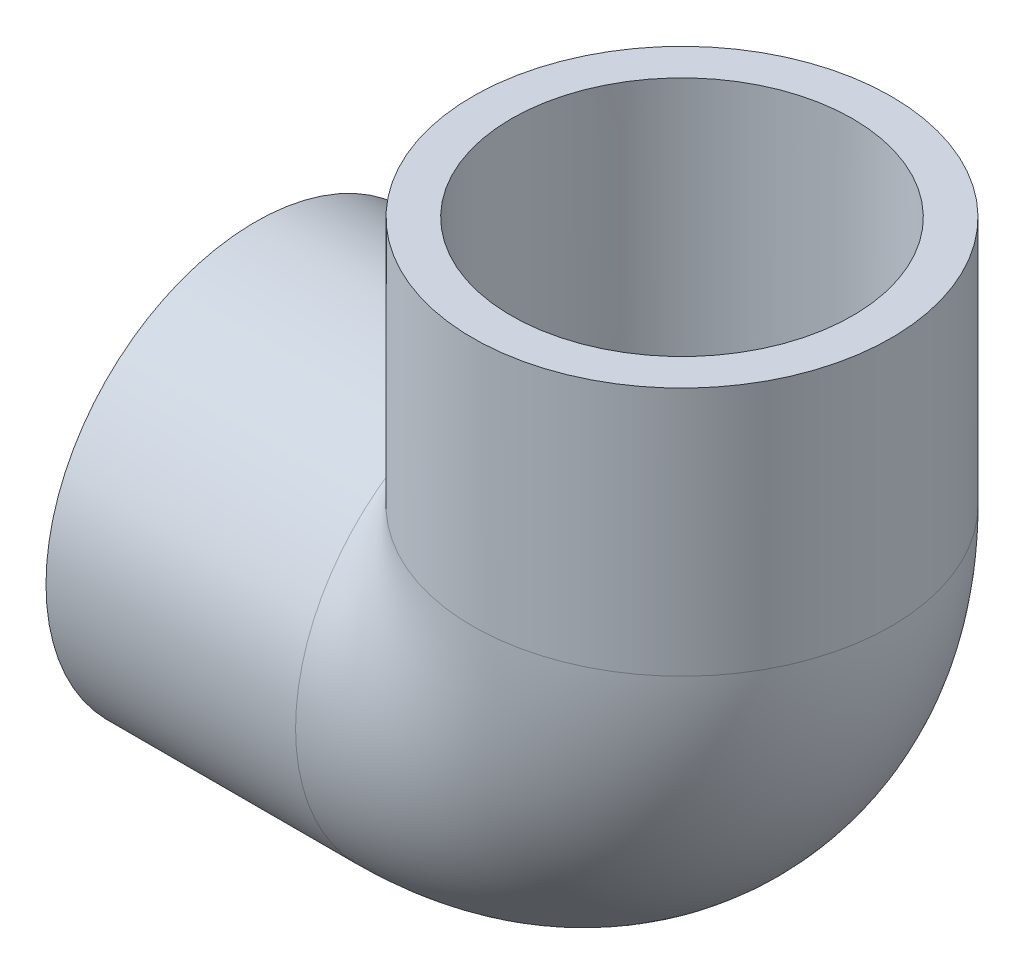
ISO-10303-21;
HEADER;
FILE_DESCRIPTION(('STEP AP214'),'2;1');
FILE_NAME('part.step','',(''),(''),'','','');
FILE_SCHEMA(('AUTOMOTIVE_DESIGN { 1 0 10303 214 1 1 1 1 }'));
ENDSEC;
DATA;
#1=APPLICATION_CONTEXT('core data for automotive mechanical design processes');
#2=APPLICATION_PROTOCOL_DEFINITION('international standard','automotive_design',2000,#1);
#3=PRODUCT_CONTEXT('',#1,'mechanical');
#4=PRODUCT('Part','Part','',(#3));
#5=PRODUCT_RELATED_PRODUCT_CATEGORY('part','',(#4));
#6=PRODUCT_DEFINITION_FORMATION('','',#4);
#7=PRODUCT_DEFINITION_CONTEXT('part definition',#1,'design');
#8=PRODUCT_DEFINITION('design','',#6,#7);
#9=PRODUCT_DEFINITION_SHAPE('','',#8);
#10=(LENGTH_UNIT() NAMED_UNIT(*) SI_UNIT(.MILLI.,.METRE.));
#11=(NAMED_UNIT(*) PLANE_ANGLE_UNIT() SI_UNIT($,.RADIAN.));
#12=(NAMED_UNIT(*) SI_UNIT($,.STERADIAN.) SOLID_ANGLE_UNIT());
#13=UNCERTAINTY_MEASURE_WITH_UNIT(LENGTH_MEASURE(1.E-05),#10,'distance_accuracy_value','');
#14=(GEOMETRIC_REPRESENTATION_CONTEXT(3) GLOBAL_UNCERTAINTY_ASSIGNED_CONTEXT((#13)) GLOBAL_UNIT_ASSIGNED_CONTEXT((#10,
#11,#12)) REPRESENTATION_CONTEXT('',''));
#15=CARTESIAN_POINT('',(0.,0.,0.));
#16=DIRECTION('',(0.,0.,1.));
#17=DIRECTION('',(1.,0.,0.));
#18=AXIS2_PLACEMENT_3D('',#15,#16,#17);
#19=CARTESIAN_POINT('',(-42.06875,-20.6375,0.));
#20=DIRECTION('',(-1.,0.,0.));
#21=DIRECTION('',(0.,0.,1.));
#22=AXIS2_PLACEMENT_3D('',#19,#20,#21);
#23=PLANE('',#22);
#24=CARTESIAN_POINT('',(-42.06875,0.,0.));
#25=DIRECTION('',(-1.,0.,0.));
#26=DIRECTION('',(0.,0.,1.));
#27=AXIS2_PLACEMENT_3D('',#24,#25,#26);
#28=CIRCLE('',#27,20.6375);
#29=CARTESIAN_POINT('',(-42.06875,0.,20.6375));
#30=VERTEX_POINT('',#29);
#31=EDGE_CURVE('E52',#30,#30,#28,.T.);
#32=ORIENTED_EDGE('',*,*,#31,.T.);
#33=EDGE_LOOP('',(#32));
#34=FACE_BOUND('',#33,.T.);
#35=CARTESIAN_POINT('',(-42.06875,0.,0.));
#36=DIRECTION('',(-1.,0.,0.));
#37=DIRECTION('',(0.,0.,1.));
#38=AXIS2_PLACEMENT_3D('',#35,#36,#37);
#39=CIRCLE('',#38,16.8275);
#40=CARTESIAN_POINT('',(-42.06875,0.,16.8275));
#41=VERTEX_POINT('',#40);
#42=EDGE_CURVE('E39',#41,#41,#39,.T.);
#43=ORIENTED_EDGE('',*,*,#42,.F.);
#44=EDGE_LOOP('',(#43));
#45=FACE_BOUND('',#44,.T.);
#46=ADVANCED_FACE('F32',(#34,#45),#23,.T.);
#47=CARTESIAN_POINT('',(-17.4625,0.,0.));
#48=DIRECTION('',(-1.,0.,0.));
#49=DIRECTION('',(0.,0.,1.));
#50=AXIS2_PLACEMENT_3D('',#47,#48,#49);
#51=CONICAL_SURFACE('',#50,16.637,0.00774178081184612);
#52=ORIENTED_EDGE('',*,*,#42,.T.);
#53=EDGE_LOOP('',(#52));
#54=FACE_BOUND('',#53,.T.);
#55=CARTESIAN_POINT('',(-17.4625,0.,0.));
#56=DIRECTION('',(-1.,0.,0.));
#57=DIRECTION('',(0.,0.,1.));
#58=AXIS2_PLACEMENT_3D('',#55,#56,#57);
#59=CIRCLE('',#58,16.637);
#60=CARTESIAN_POINT('',(-17.4625,0.,16.637));
#61=VERTEX_POINT('',#60);
#62=EDGE_CURVE('E63',#61,#61,#59,.T.);
#63=ORIENTED_EDGE('',*,*,#62,.F.);
#64=EDGE_LOOP('',(#63));
#65=FACE_BOUND('',#64,.T.);
#66=ADVANCED_FACE('F72',(#54,#65),#51,.F.);
#67=CARTESIAN_POINT('',(-42.06875,0.,0.));
#68=DIRECTION('',(-1.,0.,0.));
#69=DIRECTION('',(0.,0.,1.));
#70=AXIS2_PLACEMENT_3D('',#67,#68,#69);
#71=CYLINDRICAL_SURFACE('',#70,20.6375);
#72=CARTESIAN_POINT('',(0.,0.,0.));
#73=DIRECTION('',(-0.707106781186547,-0.707106781186547,0.));
#74=DIRECTION('',(-0.707106781186547,0.707106781186547,0.));
#75=AXIS2_PLACEMENT_3D('',#72,#73,#74);
#76=ELLIPSE('',#75,29.1858323934747,20.6375);
#77=CARTESIAN_POINT('',(-17.4625,17.4625,-10.9985226280624));
#78=VERTEX_POINT('',#77);
#79=CARTESIAN_POINT('',(-17.4625,17.4625,10.9985226280624));
#80=VERTEX_POINT('',#79);
#81=EDGE_CURVE('E51',#78,#80,#76,.F.);
#82=ORIENTED_EDGE('',*,*,#81,.F.);
#83=CARTESIAN_POINT('',(-17.4625,0.,0.));
#84=DIRECTION('',(-1.,0.,0.));
#85=DIRECTION('',(0.,0.,1.));
#86=AXIS2_PLACEMENT_3D('',#83,#84,#85);
#87=CIRCLE('',#86,20.6375);
#88=EDGE_CURVE('E58',#78,#80,#87,.T.);
#89=ORIENTED_EDGE('',*,*,#88,.T.);
#90=EDGE_LOOP('',(#82,#89));
#91=FACE_BOUND('',#90,.T.);
#92=ORIENTED_EDGE('',*,*,#31,.F.);
#93=EDGE_LOOP('',(#92));
#94=FACE_BOUND('',#93,.T.);
#95=ADVANCED_FACE('F56',(#91,#94),#71,.T.);
#96=CARTESIAN_POINT('',(-17.4625,17.4625,0.));
#97=DIRECTION('',(0.,0.,-1.));
#98=DIRECTION('',(-1.,0.,0.));
#99=AXIS2_PLACEMENT_3D('',#96,#97,#98);
#100=TOROIDAL_SURFACE('',#99,17.4625,13.3223);
#101=CARTESIAN_POINT('',(0.,17.4625,0.));
#102=DIRECTION('',(0.,1.,0.));
#103=DIRECTION('',(0.,0.,-1.));
#104=AXIS2_PLACEMENT_3D('',#101,#102,#103);
#105=CIRCLE('',#104,13.3223);
#106=CARTESIAN_POINT('',(13.3223,17.4625,0.));
#107=VERTEX_POINT('',#106);
#108=EDGE_CURVE('E53',#107,#107,#105,.T.);
#109=CARTESIAN_POINT('',(-17.4625,0.,0.));
#110=DIRECTION('',(1.,0.,0.));
#111=DIRECTION('',(0.,0.,-1.));
#112=AXIS2_PLACEMENT_3D('',#109,#110,#111);
#113=CIRCLE('',#112,13.3223);
#114=CARTESIAN_POINT('',(-17.4625,-13.3223,0.));
#115=VERTEX_POINT('',#114);
#116=EDGE_CURVE('E59',#115,#115,#113,.T.);
#117=CARTESIAN_POINT('',(-17.4625,17.4625,0.));
#118=DIRECTION('',(0.,0.,-1.));
#119=DIRECTION('',(-1.,0.,0.));
#120=AXIS2_PLACEMENT_3D('',#117,#118,#119);
#121=CIRCLE('',#120,30.7848);
#122=EDGE_CURVE('',#107,#115,#121,.T.);
#123=ORIENTED_EDGE('',*,*,#108,.T.);
#124=ORIENTED_EDGE('',*,*,#116,.F.);
#125=ORIENTED_EDGE('',*,*,#122,.T.);
#126=ORIENTED_EDGE('',*,*,#122,.F.);
#127=EDGE_LOOP('',(#123,#125,#124,#126));
#128=FACE_BOUND('',#127,.T.);
#129=ADVANCED_FACE('F82',(#128),#100,.F.);
#130=CARTESIAN_POINT('',(-34.925,17.4625,0.));
#131=DIRECTION('',(0.,-1.,0.));
#132=DIRECTION('',(-1.,0.,0.));
#133=AXIS2_PLACEMENT_3D('',#130,#131,#132);
#134=CIRCLE('',#133,20.6375);
#135=TRIMMED_CURVE('',#134,(PARAMETER_VALUE(-2.57952285058417)),
(PARAMETER_VALUE(2.57952285058417)),.T.,.PARAMETER.);
#136=CARTESIAN_POINT('',(-17.4625,17.4625,0.));
#137=DIRECTION('',(0.,0.,-1.));
#138=AXIS1_PLACEMENT('',#136,#137);
#139=SURFACE_OF_REVOLUTION('',#135,#138);
#140=CARTESIAN_POINT('',(0.,17.4625,0.));
#141=DIRECTION('',(0.,1.,0.));
#142=DIRECTION('',(0.,0.,-1.));
#143=AXIS2_PLACEMENT_3D('',#140,#141,#142);
#144=CIRCLE('',#143,20.6375);
#145=EDGE_CURVE('E45',#80,#78,#144,.T.);
#146=ORIENTED_EDGE('',*,*,#145,.F.);
#147=ORIENTED_EDGE('',*,*,#88,.F.);
#148=EDGE_LOOP('',(#146,#147));
#149=FACE_BOUND('',#148,.T.);
#150=ADVANCED_FACE('F62',(#149),#139,.T.);
#151=CARTESIAN_POINT('',(0.,17.4625,0.));
#152=DIRECTION('',(0.,1.,0.));
#153=DIRECTION('',(0.,0.,-1.));
#154=AXIS2_PLACEMENT_3D('',#151,#152,#153);
#155=PLANE('',#154);
#156=CARTESIAN_POINT('',(0.,17.4625,0.));
#157=DIRECTION('',(0.,1.,0.));
#158=DIRECTION('',(-1.,0.,0.));
#159=AXIS2_PLACEMENT_3D('',#156,#157,#158);
#160=CIRCLE('',#159,16.637);
#161=CARTESIAN_POINT('',(-16.637,17.4625,0.));
#162=VERTEX_POINT('',#161);
#163=EDGE_CURVE('E11',#162,#162,#160,.F.);
#164=ORIENTED_EDGE('',*,*,#163,.F.);
#165=EDGE_LOOP('',(#164));
#166=FACE_BOUND('',#165,.T.);
#167=ORIENTED_EDGE('',*,*,#108,.F.);
#168=EDGE_LOOP('',(#167));
#169=FACE_BOUND('',#168,.T.);
#170=ADVANCED_FACE('F89',(#166,#169),#155,.T.);
#171=CARTESIAN_POINT('',(-17.4625,0.,0.));
#172=DIRECTION('',(1.,0.,0.));
#173=DIRECTION('',(0.,0.,-1.));
#174=AXIS2_PLACEMENT_3D('',#171,#172,#173);
#175=PLANE('',#174);
#176=ORIENTED_EDGE('',*,*,#62,.T.);
#177=EDGE_LOOP('',(#176));
#178=FACE_BOUND('',#177,.T.);
#179=ORIENTED_EDGE('',*,*,#116,.T.);
#180=EDGE_LOOP('',(#179));
#181=FACE_BOUND('',#180,.T.);
#182=ADVANCED_FACE('F92',(#178,#181),#175,.F.);
#183=CARTESIAN_POINT('',(20.6375,42.06875,0.));
#184=DIRECTION('',(0.,1.,0.));
#185=DIRECTION('',(0.,0.,1.));
#186=AXIS2_PLACEMENT_3D('',#183,#184,#185);
#187=PLANE('',#186);
#188=CARTESIAN_POINT('',(0.,42.06875,0.));
#189=DIRECTION('',(0.,-1.,0.));
#190=DIRECTION('',(0.,0.,-1.));
#191=AXIS2_PLACEMENT_3D('',#188,#189,#190);
#192=CIRCLE('',#191,16.8275);
#193=CARTESIAN_POINT('',(0.,42.06875,-16.8275));
#194=VERTEX_POINT('',#193);
#195=EDGE_CURVE('E116',#194,#194,#192,.T.);
#196=ORIENTED_EDGE('',*,*,#195,.T.);
#197=EDGE_LOOP('',(#196));
#198=FACE_BOUND('',#197,.T.);
#199=CARTESIAN_POINT('',(0.,42.06875,0.));
#200=DIRECTION('',(0.,-1.,0.));
#201=DIRECTION('',(0.,0.,-1.));
#202=AXIS2_PLACEMENT_3D('',#199,#200,#201);
#203=CIRCLE('',#202,20.6375);
#204=CARTESIAN_POINT('',(0.,42.06875,-20.6375));
#205=VERTEX_POINT('',#204);
#206=EDGE_CURVE('E60',#205,#205,#203,.T.);
#207=ORIENTED_EDGE('',*,*,#206,.F.);
#208=EDGE_LOOP('',(#207));
#209=FACE_BOUND('',#208,.T.);
#210=ADVANCED_FACE('F99',(#198,#209),#187,.T.);
#211=CARTESIAN_POINT('',(0.,0.,0.));
#212=DIRECTION('',(0.,-1.,0.));
#213=DIRECTION('',(0.,0.,-1.));
#214=AXIS2_PLACEMENT_3D('',#211,#212,#213);
#215=CYLINDRICAL_SURFACE('',#214,20.6375);
#216=ORIENTED_EDGE('',*,*,#206,.T.);
#217=EDGE_LOOP('',(#216));
#218=FACE_BOUND('',#217,.T.);
#219=ORIENTED_EDGE('',*,*,#145,.T.);
#220=ORIENTED_EDGE('',*,*,#81,.T.);
#221=EDGE_LOOP('',(#219,#220));
#222=FACE_BOUND('',#221,.T.);
#223=ADVANCED_FACE('F50',(#218,#222),#215,.T.);
#224=CARTESIAN_POINT('',(0.,42.06875,0.));
#225=DIRECTION('',(0.,1.,0.));
#226=DIRECTION('',(0.,0.,1.));
#227=AXIS2_PLACEMENT_3D('',#224,#225,#226);
#228=CONICAL_SURFACE('',#227,16.8275,0.00774178081184612);
#229=ORIENTED_EDGE('',*,*,#163,.T.);
#230=EDGE_LOOP('',(#229));
#231=FACE_BOUND('',#230,.T.);
#232=ORIENTED_EDGE('',*,*,#195,.F.);
#233=EDGE_LOOP('',(#232));
#234=FACE_BOUND('',#233,.T.);
#235=ADVANCED_FACE('F106',(#231,#234),#228,.F.);
#236=CLOSED_SHELL('',(#46,#66,#95,#129,#150,#170,#182,#210,#223,#235));
#237=MANIFOLD_SOLID_BREP('B2',#236);
#238=ADVANCED_BREP_SHAPE_REPRESENTATION('',(#18,#237),#14);
#239=SHAPE_DEFINITION_REPRESENTATION(#9,#238);
ENDSEC;
END-ISO-10303-21;
